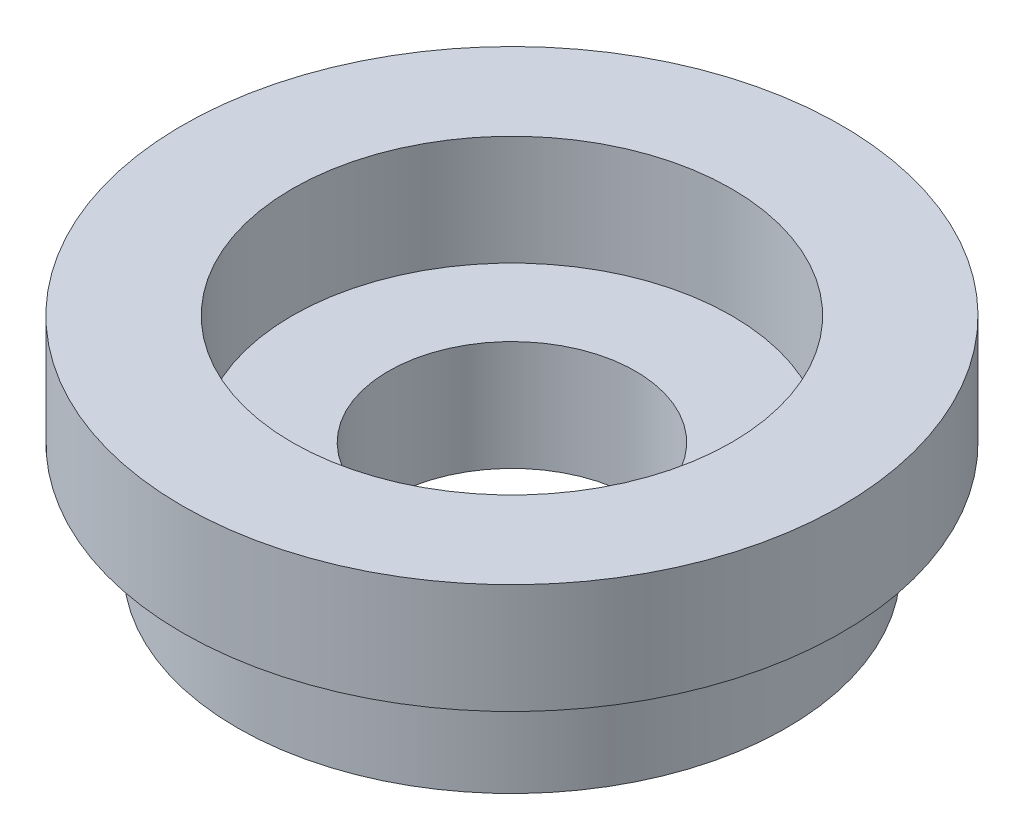
ISO-10303-21;
HEADER;
FILE_DESCRIPTION(('STEP AP214'),'2;1');
FILE_NAME('part.step','',(''),(''),'','','');
FILE_SCHEMA(('AUTOMOTIVE_DESIGN { 1 0 10303 214 1 1 1 1 }'));
ENDSEC;
DATA;
#1=APPLICATION_CONTEXT('core data for automotive mechanical design processes');
#2=APPLICATION_PROTOCOL_DEFINITION('international standard','automotive_design',2000,#1);
#3=PRODUCT_CONTEXT('',#1,'mechanical');
#4=PRODUCT('Part','Part','',(#3));
#5=PRODUCT_RELATED_PRODUCT_CATEGORY('part','',(#4));
#6=PRODUCT_DEFINITION_FORMATION('','',#4);
#7=PRODUCT_DEFINITION_CONTEXT('part definition',#1,'design');
#8=PRODUCT_DEFINITION('design','',#6,#7);
#9=PRODUCT_DEFINITION_SHAPE('','',#8);
#10=(LENGTH_UNIT() NAMED_UNIT(*) SI_UNIT(.MILLI.,.METRE.));
#11=(NAMED_UNIT(*) PLANE_ANGLE_UNIT() SI_UNIT($,.RADIAN.));
#12=(NAMED_UNIT(*) SI_UNIT($,.STERADIAN.) SOLID_ANGLE_UNIT());
#13=UNCERTAINTY_MEASURE_WITH_UNIT(LENGTH_MEASURE(1.E-05),#10,'distance_accuracy_value','');
#14=(GEOMETRIC_REPRESENTATION_CONTEXT(3) GLOBAL_UNCERTAINTY_ASSIGNED_CONTEXT((#13)) GLOBAL_UNIT_ASSIGNED_CONTEXT((#10,
#11,#12)) REPRESENTATION_CONTEXT('',''));
#15=CARTESIAN_POINT('',(0.,0.,0.));
#16=DIRECTION('',(0.,0.,1.));
#17=DIRECTION('',(1.,0.,0.));
#18=AXIS2_PLACEMENT_3D('',#15,#16,#17);
#19=CARTESIAN_POINT('',(0.,2.,0.));
#20=DIRECTION('',(0.,-1.,0.));
#21=DIRECTION('',(0.,0.,-1.));
#22=AXIS2_PLACEMENT_3D('',#19,#20,#21);
#23=CYLINDRICAL_SURFACE('',#22,5.);
#24=CARTESIAN_POINT('',(0.,2.,0.));
#25=DIRECTION('',(0.,1.,0.));
#26=DIRECTION('',(0.,0.,1.));
#27=AXIS2_PLACEMENT_3D('',#24,#25,#26);
#28=CIRCLE('',#27,5.);
#29=CARTESIAN_POINT('',(0.,2.,5.));
#30=VERTEX_POINT('',#29);
#31=EDGE_CURVE('E10',#30,#30,#28,.T.);
#32=ORIENTED_EDGE('',*,*,#31,.F.);
#33=EDGE_LOOP('',(#32));
#34=FACE_BOUND('',#33,.T.);
#35=CARTESIAN_POINT('',(0.,0.,0.));
#36=DIRECTION('',(0.,1.,0.));
#37=DIRECTION('',(0.,0.,1.));
#38=AXIS2_PLACEMENT_3D('',#35,#36,#37);
#39=CIRCLE('',#38,5.);
#40=CARTESIAN_POINT('',(0.,0.,5.));
#41=VERTEX_POINT('',#40);
#42=EDGE_CURVE('E33',#41,#41,#39,.T.);
#43=ORIENTED_EDGE('',*,*,#42,.T.);
#44=EDGE_LOOP('',(#43));
#45=FACE_BOUND('',#44,.T.);
#46=ADVANCED_FACE('F30',(#34,#45),#23,.T.);
#47=CARTESIAN_POINT('',(0.,0.,0.));
#48=DIRECTION('',(0.,1.,0.));
#49=DIRECTION('',(0.,0.,1.));
#50=AXIS2_PLACEMENT_3D('',#47,#48,#49);
#51=PLANE('',#50);
#52=CARTESIAN_POINT('',(0.,0.,0.));
#53=DIRECTION('',(0.,1.,0.));
#54=DIRECTION('',(0.,0.,1.));
#55=AXIS2_PLACEMENT_3D('',#52,#53,#54);
#56=CIRCLE('',#55,2.25);
#57=CARTESIAN_POINT('',(0.,0.,2.25));
#58=VERTEX_POINT('',#57);
#59=EDGE_CURVE('E45',#58,#58,#56,.T.);
#60=ORIENTED_EDGE('',*,*,#59,.T.);
#61=EDGE_LOOP('',(#60));
#62=FACE_BOUND('',#61,.T.);
#63=ORIENTED_EDGE('',*,*,#42,.F.);
#64=EDGE_LOOP('',(#63));
#65=FACE_BOUND('',#64,.T.);
#66=ADVANCED_FACE('F72',(#62,#65),#51,.F.);
#67=CARTESIAN_POINT('',(0.,4.,0.));
#68=DIRECTION('',(0.,-1.,0.));
#69=DIRECTION('',(0.,0.,-1.));
#70=AXIS2_PLACEMENT_3D('',#67,#68,#69);
#71=CYLINDRICAL_SURFACE('',#70,6.);
#72=CARTESIAN_POINT('',(0.,4.,0.));
#73=DIRECTION('',(0.,1.,0.));
#74=DIRECTION('',(0.,0.,1.));
#75=AXIS2_PLACEMENT_3D('',#72,#73,#74);
#76=CIRCLE('',#75,6.);
#77=CARTESIAN_POINT('',(0.,4.,6.));
#78=VERTEX_POINT('',#77);
#79=EDGE_CURVE('E40',#78,#78,#76,.T.);
#80=ORIENTED_EDGE('',*,*,#79,.F.);
#81=EDGE_LOOP('',(#80));
#82=FACE_BOUND('',#81,.T.);
#83=CARTESIAN_POINT('',(0.,2.,0.));
#84=DIRECTION('',(0.,1.,0.));
#85=DIRECTION('',(0.,0.,1.));
#86=AXIS2_PLACEMENT_3D('',#83,#84,#85);
#87=CIRCLE('',#86,6.);
#88=CARTESIAN_POINT('',(0.,2.,6.));
#89=VERTEX_POINT('',#88);
#90=EDGE_CURVE('E42',#89,#89,#87,.T.);
#91=ORIENTED_EDGE('',*,*,#90,.T.);
#92=EDGE_LOOP('',(#91));
#93=FACE_BOUND('',#92,.T.);
#94=ADVANCED_FACE('F66',(#82,#93),#71,.T.);
#95=CARTESIAN_POINT('',(0.,4.,0.));
#96=DIRECTION('',(0.,1.,0.));
#97=DIRECTION('',(0.,0.,1.));
#98=AXIS2_PLACEMENT_3D('',#95,#96,#97);
#99=PLANE('',#98);
#100=CARTESIAN_POINT('',(0.,4.,0.));
#101=DIRECTION('',(0.,1.,0.));
#102=DIRECTION('',(0.,0.,1.));
#103=AXIS2_PLACEMENT_3D('',#100,#101,#102);
#104=CIRCLE('',#103,4.);
#105=CARTESIAN_POINT('',(0.,4.,4.));
#106=VERTEX_POINT('',#105);
#107=EDGE_CURVE('E56',#106,#106,#104,.T.);
#108=ORIENTED_EDGE('',*,*,#107,.F.);
#109=EDGE_LOOP('',(#108));
#110=FACE_BOUND('',#109,.T.);
#111=ORIENTED_EDGE('',*,*,#79,.T.);
#112=EDGE_LOOP('',(#111));
#113=FACE_BOUND('',#112,.T.);
#114=ADVANCED_FACE('F62',(#110,#113),#99,.T.);
#115=CARTESIAN_POINT('',(0.,2.,0.));
#116=DIRECTION('',(0.,1.,0.));
#117=DIRECTION('',(0.,0.,1.));
#118=AXIS2_PLACEMENT_3D('',#115,#116,#117);
#119=PLANE('',#118);
#120=ORIENTED_EDGE('',*,*,#31,.T.);
#121=EDGE_LOOP('',(#120));
#122=FACE_BOUND('',#121,.T.);
#123=ORIENTED_EDGE('',*,*,#90,.F.);
#124=EDGE_LOOP('',(#123));
#125=FACE_BOUND('',#124,.T.);
#126=ADVANCED_FACE('F65',(#122,#125),#119,.F.);
#127=CARTESIAN_POINT('',(0.,4.,0.));
#128=DIRECTION('',(0.,1.,0.));
#129=DIRECTION('',(0.,0.,1.));
#130=AXIS2_PLACEMENT_3D('',#127,#128,#129);
#131=CYLINDRICAL_SURFACE('',#130,2.25);
#132=ORIENTED_EDGE('',*,*,#59,.F.);
#133=EDGE_LOOP('',(#132));
#134=FACE_BOUND('',#133,.T.);
#135=CARTESIAN_POINT('',(0.,2.,0.));
#136=DIRECTION('',(0.,1.,0.));
#137=DIRECTION('',(0.,0.,1.));
#138=AXIS2_PLACEMENT_3D('',#135,#136,#137);
#139=CIRCLE('',#138,2.25);
#140=CARTESIAN_POINT('',(0.,2.,2.25));
#141=VERTEX_POINT('',#140);
#142=EDGE_CURVE('E50',#141,#141,#139,.T.);
#143=ORIENTED_EDGE('',*,*,#142,.T.);
#144=EDGE_LOOP('',(#143));
#145=FACE_BOUND('',#144,.T.);
#146=ADVANCED_FACE('F77',(#134,#145),#131,.F.);
#147=CARTESIAN_POINT('',(2.25,2.,0.));
#148=DIRECTION('',(0.,-1.,0.));
#149=DIRECTION('',(0.,0.,-1.));
#150=AXIS2_PLACEMENT_3D('',#147,#148,#149);
#151=PLANE('',#150);
#152=ORIENTED_EDGE('',*,*,#142,.F.);
#153=EDGE_LOOP('',(#152));
#154=FACE_BOUND('',#153,.T.);
#155=CARTESIAN_POINT('',(0.,2.,0.));
#156=DIRECTION('',(0.,1.,0.));
#157=DIRECTION('',(0.,0.,1.));
#158=AXIS2_PLACEMENT_3D('',#155,#156,#157);
#159=CIRCLE('',#158,4.);
#160=CARTESIAN_POINT('',(0.,2.,4.));
#161=VERTEX_POINT('',#160);
#162=EDGE_CURVE('E53',#161,#161,#159,.T.);
#163=ORIENTED_EDGE('',*,*,#162,.T.);
#164=EDGE_LOOP('',(#163));
#165=FACE_BOUND('',#164,.T.);
#166=ADVANCED_FACE('F82',(#154,#165),#151,.F.);
#167=CARTESIAN_POINT('',(0.,4.,0.));
#168=DIRECTION('',(0.,1.,0.));
#169=DIRECTION('',(0.,0.,1.));
#170=AXIS2_PLACEMENT_3D('',#167,#168,#169);
#171=CYLINDRICAL_SURFACE('',#170,4.);
#172=ORIENTED_EDGE('',*,*,#162,.F.);
#173=EDGE_LOOP('',(#172));
#174=FACE_BOUND('',#173,.T.);
#175=ORIENTED_EDGE('',*,*,#107,.T.);
#176=EDGE_LOOP('',(#175));
#177=FACE_BOUND('',#176,.T.);
#178=ADVANCED_FACE('F60',(#174,#177),#171,.F.);
#179=CLOSED_SHELL('',(#46,#66,#94,#114,#126,#146,#166,#178));
#180=MANIFOLD_SOLID_BREP('B2',#179);
#181=ADVANCED_BREP_SHAPE_REPRESENTATION('',(#18,#180),#14);
#182=SHAPE_DEFINITION_REPRESENTATION(#9,#181);
ENDSEC;
END-ISO-10303-21;
